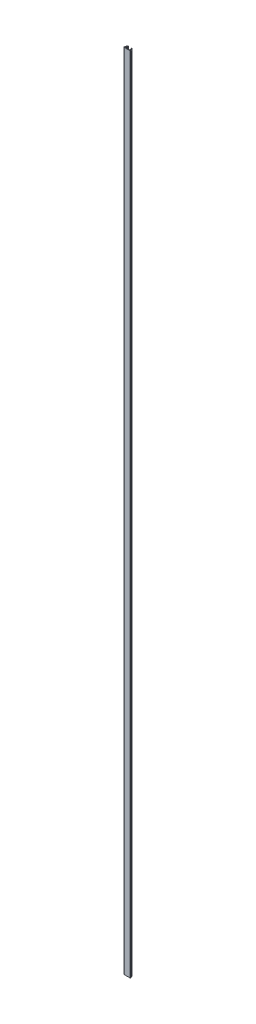
ISO-10303-21;
HEADER;
FILE_DESCRIPTION(('STEP AP214'),'2;1');
FILE_NAME('part.step','',(''),(''),'','','');
FILE_SCHEMA(('AUTOMOTIVE_DESIGN { 1 0 10303 214 1 1 1 1 }'));
ENDSEC;
DATA;
#1=APPLICATION_CONTEXT('core data for automotive mechanical design processes');
#2=APPLICATION_PROTOCOL_DEFINITION('international standard','automotive_design',2000,#1);
#3=PRODUCT_CONTEXT('',#1,'mechanical');
#4=PRODUCT('Part','Part','',(#3));
#5=PRODUCT_RELATED_PRODUCT_CATEGORY('part','',(#4));
#6=PRODUCT_DEFINITION_FORMATION('','',#4);
#7=PRODUCT_DEFINITION_CONTEXT('part definition',#1,'design');
#8=PRODUCT_DEFINITION('design','',#6,#7);
#9=PRODUCT_DEFINITION_SHAPE('','',#8);
#10=(LENGTH_UNIT() NAMED_UNIT(*) SI_UNIT(.MILLI.,.METRE.));
#11=(NAMED_UNIT(*) PLANE_ANGLE_UNIT() SI_UNIT($,.RADIAN.));
#12=(NAMED_UNIT(*) SI_UNIT($,.STERADIAN.) SOLID_ANGLE_UNIT());
#13=UNCERTAINTY_MEASURE_WITH_UNIT(LENGTH_MEASURE(1.E-05),#10,'distance_accuracy_value','');
#14=(GEOMETRIC_REPRESENTATION_CONTEXT(3) GLOBAL_UNCERTAINTY_ASSIGNED_CONTEXT((#13)) GLOBAL_UNIT_ASSIGNED_CONTEXT((#10,
#11,#12)) REPRESENTATION_CONTEXT('',''));
#15=CARTESIAN_POINT('',(0.,0.,0.));
#16=DIRECTION('',(0.,0.,1.));
#17=DIRECTION('',(1.,0.,0.));
#18=AXIS2_PLACEMENT_3D('',#15,#16,#17);
#19=CARTESIAN_POINT('',(2.65573064766504,1180.,-3.30246448484874));
#20=DIRECTION('',(0.,-1.,0.));
#21=DIRECTION('',(0.,0.,-1.));
#22=AXIS2_PLACEMENT_3D('',#19,#20,#21);
#23=CYLINDRICAL_SURFACE('',#22,0.40000394012978);
#24=CARTESIAN_POINT('',(2.65573064766504,1180.,-3.30246448484874));
#25=DIRECTION('',(0.,-1.,0.));
#26=DIRECTION('',(0.,0.,-1.));
#27=AXIS2_PLACEMENT_3D('',#24,#25,#26);
#28=CIRCLE('',#27,0.40000394012978);
#29=CARTESIAN_POINT('',(2.40672362175113,1180.,-2.98941711917829));
#30=VERTEX_POINT('',#29);
#31=CARTESIAN_POINT('',(2.90473880006085,1180.,-3.61551095447925));
#32=VERTEX_POINT('',#31);
#33=EDGE_CURVE('E227',#30,#32,#28,.T.);
#34=ORIENTED_EDGE('',*,*,#33,.T.);
#35=DIRECTION('',(0.,1.,0.));
#36=VECTOR('',#35,1.);
#37=CARTESIAN_POINT('',(2.90473725827043,1180.,-3.61551218088588));
#38=LINE('',#37,#36);
#39=CARTESIAN_POINT('',(2.90473880006185,0.,-3.61551095448257));
#40=VERTEX_POINT('',#39);
#41=EDGE_CURVE('E229',#40,#32,#38,.T.);
#42=ORIENTED_EDGE('',*,*,#41,.F.);
#43=CARTESIAN_POINT('',(2.65573064766504,0.,-3.30246448485286));
#44=DIRECTION('',(0.,-1.,0.));
#45=DIRECTION('',(0.,0.,-1.));
#46=AXIS2_PLACEMENT_3D('',#43,#44,#45);
#47=CIRCLE('',#46,0.40000394012978);
#48=CARTESIAN_POINT('',(2.40672362175213,0.,-2.98941711918161));
#49=VERTEX_POINT('',#48);
#50=EDGE_CURVE('E20',#40,#49,#47,.F.);
#51=ORIENTED_EDGE('',*,*,#50,.T.);
#52=DIRECTION('',(0.,1.,0.));
#53=VECTOR('',#52,1.);
#54=CARTESIAN_POINT('',(2.40672207996582,1180.,-2.989418345547));
#55=LINE('',#54,#53);
#56=EDGE_CURVE('E251',#30,#49,#55,.F.);
#57=ORIENTED_EDGE('',*,*,#56,.F.);
#58=EDGE_LOOP('',(#34,#42,#51,#57));
#59=FACE_BOUND('',#58,.T.);
#60=ADVANCED_FACE('F17',(#59),#23,.T.);
#61=CARTESIAN_POINT('',(-2.65573064766504,1180.,-3.30246448484874));
#62=DIRECTION('',(0.,-1.,0.));
#63=DIRECTION('',(0.,0.,-1.));
#64=AXIS2_PLACEMENT_3D('',#61,#62,#63);
#65=CYLINDRICAL_SURFACE('',#64,0.400003940129779);
#66=CARTESIAN_POINT('',(-2.65573064766504,0.,-3.30246448485286));
#67=DIRECTION('',(0.,-1.,0.));
#68=DIRECTION('',(0.,0.,-1.));
#69=AXIS2_PLACEMENT_3D('',#66,#67,#68);
#70=CIRCLE('',#69,0.400003940129779);
#71=CARTESIAN_POINT('',(-2.40672362175112,0.,-2.9894171191824));
#72=VERTEX_POINT('',#71);
#73=CARTESIAN_POINT('',(-2.90473880006286,0.,-3.61551095448178));
#74=VERTEX_POINT('',#73);
#75=EDGE_CURVE('E238',#72,#74,#70,.F.);
#76=ORIENTED_EDGE('',*,*,#75,.T.);
#77=DIRECTION('',(0.,1.,0.));
#78=VECTOR('',#77,1.);
#79=CARTESIAN_POINT('',(-2.90473725827245,1180.,-3.61551218088429));
#80=LINE('',#79,#78);
#81=CARTESIAN_POINT('',(-2.90473880006186,1180.,-3.61551095447846));
#82=VERTEX_POINT('',#81);
#83=EDGE_CURVE('E246',#82,#74,#80,.F.);
#84=ORIENTED_EDGE('',*,*,#83,.F.);
#85=CARTESIAN_POINT('',(-2.65573064766504,1180.,-3.30246448484874));
#86=DIRECTION('',(0.,-1.,0.));
#87=DIRECTION('',(0.,0.,-1.));
#88=AXIS2_PLACEMENT_3D('',#85,#86,#87);
#89=CIRCLE('',#88,0.400003940129779);
#90=CARTESIAN_POINT('',(-2.40672362175012,1180.,-2.98941711917908));
#91=VERTEX_POINT('',#90);
#92=EDGE_CURVE('E241',#82,#91,#89,.T.);
#93=ORIENTED_EDGE('',*,*,#92,.T.);
#94=DIRECTION('',(0.,1.,0.));
#95=VECTOR('',#94,1.);
#96=CARTESIAN_POINT('',(-2.4067220799638,1180.,-2.98941834554859));
#97=LINE('',#96,#95);
#98=EDGE_CURVE('E255',#72,#91,#97,.T.);
#99=ORIENTED_EDGE('',*,*,#98,.F.);
#100=EDGE_LOOP('',(#76,#84,#93,#99));
#101=FACE_BOUND('',#100,.T.);
#102=ADVANCED_FACE('F350',(#101),#65,.T.);
#103=CARTESIAN_POINT('',(2.90473725827244,1180.,-3.61551218088428));
#104=DIRECTION('',(0.622518103490472,0.,-0.7826053991806));
#105=DIRECTION('',(-0.7826053991806,0.,-0.622518103490472));
#106=AXIS2_PLACEMENT_3D('',#103,#104,#105);
#107=PLANE('',#106);
#108=DIRECTION('',(-0.7826053991806,0.,-0.622518103490472));
#109=VECTOR('',#108,1.);
#110=CARTESIAN_POINT('',(2.90473725827244,1180.,-3.61551218088428));
#111=LINE('',#110,#109);
#112=CARTESIAN_POINT('',(3.7224190253596,1180.,-2.96509282083541));
#113=VERTEX_POINT('',#112);
#114=EDGE_CURVE('E232',#32,#113,#111,.F.);
#115=ORIENTED_EDGE('',*,*,#114,.T.);
#116=DIRECTION('',(0.,-1.,0.));
#117=VECTOR('',#116,1.);
#118=CARTESIAN_POINT('',(3.72241720460955,1180.,-2.96509426913857));
#119=LINE('',#118,#117);
#120=CARTESIAN_POINT('',(3.7224190253596,0.,-2.96509282083953));
#121=VERTEX_POINT('',#120);
#122=EDGE_CURVE('E236',#121,#113,#119,.F.);
#123=ORIENTED_EDGE('',*,*,#122,.F.);
#124=DIRECTION('',(-0.7826053991806,0.,-0.622518103490472));
#125=VECTOR('',#124,1.);
#126=CARTESIAN_POINT('',(2.90473725827445,0.,-3.6155121808868));
#127=LINE('',#126,#125);
#128=EDGE_CURVE('E220',#121,#40,#127,.T.);
#129=ORIENTED_EDGE('',*,*,#128,.T.);
#130=ORIENTED_EDGE('',*,*,#41,.T.);
#131=EDGE_LOOP('',(#115,#123,#129,#130));
#132=FACE_BOUND('',#131,.T.);
#133=ADVANCED_FACE('F234',(#132),#107,.T.);
#134=CARTESIAN_POINT('',(-2.40672207996581,1180.,-2.98941834554699));
#135=DIRECTION('',(0.622507578450082,0.,0.782613771136322));
#136=DIRECTION('',(0.782613771136322,0.,-0.622507578450082));
#137=AXIS2_PLACEMENT_3D('',#134,#135,#136);
#138=PLANE('',#137);
#139=DIRECTION('',(0.782613771136322,0.,-0.622507578450082));
#140=VECTOR('',#139,1.);
#141=CARTESIAN_POINT('',(-2.40672207996581,1180.,-2.98941834554699));
#142=LINE('',#141,#140);
#143=CARTESIAN_POINT('',(-3.22440293600794,1180.,-2.33901766463294));
#144=VERTEX_POINT('',#143);
#145=EDGE_CURVE('E257',#91,#144,#142,.F.);
#146=ORIENTED_EDGE('',*,*,#145,.T.);
#147=DIRECTION('',(0.,-1.,0.));
#148=VECTOR('',#147,1.);
#149=CARTESIAN_POINT('',(-3.22440445835369,1180.,-2.33901645372688));
#150=LINE('',#149,#148);
#151=CARTESIAN_POINT('',(-3.22440293600794,0.,-2.33901766463706));
#152=VERTEX_POINT('',#151);
#153=EDGE_CURVE('E340',#144,#152,#150,.T.);
#154=ORIENTED_EDGE('',*,*,#153,.T.);
#155=DIRECTION('',(0.782613771136322,0.,-0.622507578450082));
#156=VECTOR('',#155,1.);
#157=CARTESIAN_POINT('',(-2.40672207996782,0.,-2.98941834554951));
#158=LINE('',#157,#156);
#159=EDGE_CURVE('E258',#152,#72,#158,.T.);
#160=ORIENTED_EDGE('',*,*,#159,.T.);
#161=ORIENTED_EDGE('',*,*,#98,.T.);
#162=EDGE_LOOP('',(#146,#154,#160,#161));
#163=FACE_BOUND('',#162,.T.);
#164=ADVANCED_FACE('F360',(#163),#138,.T.);
#165=CARTESIAN_POINT('',(3.22440445835369,1180.,-2.33901645372688));
#166=DIRECTION('',(-0.622507578450082,0.,0.782613771136322));
#167=DIRECTION('',(0.782613771136322,0.,0.622507578450082));
#168=AXIS2_PLACEMENT_3D('',#165,#166,#167);
#169=PLANE('',#168);
#170=DIRECTION('',(0.782613771136322,0.,0.622507578450082));
#171=VECTOR('',#170,1.);
#172=CARTESIAN_POINT('',(3.22440445835369,1180.,-2.33901645372688));
#173=LINE('',#172,#171);
#174=CARTESIAN_POINT('',(3.22440293600795,1180.,-2.33901766463294));
#175=VERTEX_POINT('',#174);
#176=EDGE_CURVE('E254',#175,#30,#173,.F.);
#177=ORIENTED_EDGE('',*,*,#176,.T.);
#178=ORIENTED_EDGE('',*,*,#56,.T.);
#179=DIRECTION('',(0.782613771136322,0.,0.622507578450082));
#180=VECTOR('',#179,1.);
#181=CARTESIAN_POINT('',(3.2244044583557,0.,-2.3390164537294));
#182=LINE('',#181,#180);
#183=CARTESIAN_POINT('',(3.22440293600795,0.,-2.33901766463706));
#184=VERTEX_POINT('',#183);
#185=EDGE_CURVE('E223',#49,#184,#182,.T.);
#186=ORIENTED_EDGE('',*,*,#185,.T.);
#187=DIRECTION('',(0.,-1.,0.));
#188=VECTOR('',#187,1.);
#189=CARTESIAN_POINT('',(3.22440445835369,1180.,-2.33901645372688));
#190=LINE('',#189,#188);
#191=EDGE_CURVE('E335',#184,#175,#190,.F.);
#192=ORIENTED_EDGE('',*,*,#191,.T.);
#193=EDGE_LOOP('',(#177,#178,#186,#192));
#194=FACE_BOUND('',#193,.T.);
#195=ADVANCED_FACE('F459',(#194),#169,.T.);
#196=CARTESIAN_POINT('',(-3.72241720460956,1180.,-2.96509426913857));
#197=DIRECTION('',(-0.622518103490471,0.,-0.7826053991806));
#198=DIRECTION('',(-0.7826053991806,0.,0.622518103490471));
#199=AXIS2_PLACEMENT_3D('',#196,#197,#198);
#200=PLANE('',#199);
#201=DIRECTION('',(-0.7826053991806,0.,0.622518103490471));
#202=VECTOR('',#201,1.);
#203=CARTESIAN_POINT('',(-3.72241720460956,1180.,-2.96509426913857));
#204=LINE('',#203,#202);
#205=CARTESIAN_POINT('',(-3.7224190253596,1180.,-2.96509282083542));
#206=VERTEX_POINT('',#205);
#207=EDGE_CURVE('E250',#206,#82,#204,.F.);
#208=ORIENTED_EDGE('',*,*,#207,.T.);
#209=ORIENTED_EDGE('',*,*,#83,.T.);
#210=DIRECTION('',(-0.7826053991806,0.,0.622518103490471));
#211=VECTOR('',#210,1.);
#212=CARTESIAN_POINT('',(-3.72241720461157,-4.44089209850063E-13,-2.96509426914109));
#213=LINE('',#212,#211);
#214=CARTESIAN_POINT('',(-3.7224190253596,0.,-2.96509282083954));
#215=VERTEX_POINT('',#214);
#216=EDGE_CURVE('E253',#74,#215,#213,.T.);
#217=ORIENTED_EDGE('',*,*,#216,.T.);
#218=DIRECTION('',(0.,-1.,0.));
#219=VECTOR('',#218,1.);
#220=CARTESIAN_POINT('',(-3.72241720460956,1180.,-2.96509426913856));
#221=LINE('',#220,#219);
#222=EDGE_CURVE('E329',#206,#215,#221,.T.);
#223=ORIENTED_EDGE('',*,*,#222,.F.);
#224=EDGE_LOOP('',(#208,#209,#217,#223));
#225=FACE_BOUND('',#224,.T.);
#226=ADVANCED_FACE('F586',(#225),#200,.T.);
#227=CARTESIAN_POINT('',(3.09990726176315,1180.,-2.18249165464262));
#228=DIRECTION('',(0.,-1.,0.));
#229=DIRECTION('',(0.,0.,-1.));
#230=AXIS2_PLACEMENT_3D('',#227,#228,#229);
#231=CYLINDRICAL_SURFACE('',#230,0.999992740552911);
#232=CARTESIAN_POINT('',(3.09990726176315,1180.,-2.18249165464262));
#233=DIRECTION('',(0.,-1.,0.));
#234=DIRECTION('',(0.,0.,-1.));
#235=AXIS2_PLACEMENT_3D('',#232,#233,#234);
#236=CIRCLE('',#235,0.999992740552911);
#237=CARTESIAN_POINT('',(4.099900000451,1180.,-2.18255271238236));
#238=VERTEX_POINT('',#237);
#239=EDGE_CURVE('E343',#113,#238,#236,.T.);
#240=ORIENTED_EDGE('',*,*,#239,.T.);
#241=DIRECTION('',(0.,1.,0.));
#242=VECTOR('',#241,1.);
#243=CARTESIAN_POINT('',(4.09990000050218,1180.,-2.18255188528575));
#244=LINE('',#243,#242);
#245=CARTESIAN_POINT('',(4.099900000451,0.,-2.18255271238442));
#246=VERTEX_POINT('',#245);
#247=EDGE_CURVE('E371',#246,#238,#244,.T.);
#248=ORIENTED_EDGE('',*,*,#247,.F.);
#249=CARTESIAN_POINT('',(3.09990726176315,0.,-2.18249165464674));
#250=DIRECTION('',(0.,-1.,0.));
#251=DIRECTION('',(0.,0.,-1.));
#252=AXIS2_PLACEMENT_3D('',#249,#250,#251);
#253=CIRCLE('',#252,0.999992740552911);
#254=EDGE_CURVE('E249',#246,#121,#253,.F.);
#255=ORIENTED_EDGE('',*,*,#254,.T.);
#256=ORIENTED_EDGE('',*,*,#122,.T.);
#257=EDGE_LOOP('',(#240,#248,#255,#256));
#258=FACE_BOUND('',#257,.T.);
#259=ADVANCED_FACE('F366',(#258),#231,.T.);
#260=CARTESIAN_POINT('',(-3.09991592727241,1180.,-2.182516273277));
#261=DIRECTION('',(0.,-1.,0.));
#262=DIRECTION('',(0.,0.,-1.));
#263=AXIS2_PLACEMENT_3D('',#260,#261,#262);
#264=CYLINDRICAL_SURFACE('',#263,0.199974250471449);
#265=ORIENTED_EDGE('',*,*,#153,.F.);
#266=CARTESIAN_POINT('',(-3.09991592727241,1180.,-2.182516273277));
#267=DIRECTION('',(0.,-1.,0.));
#268=DIRECTION('',(0.,0.,-1.));
#269=AXIS2_PLACEMENT_3D('',#266,#267,#268);
#270=CIRCLE('',#269,0.199974250471449);
#271=CARTESIAN_POINT('',(-3.29988999532591,1180.,-2.18224616634789));
#272=VERTEX_POINT('',#271);
#273=EDGE_CURVE('E341',#272,#144,#270,.T.);
#274=ORIENTED_EDGE('',*,*,#273,.F.);
#275=DIRECTION('',(0.,1.,0.));
#276=VECTOR('',#275,1.);
#277=CARTESIAN_POINT('',(-3.29988999532591,1180.,-2.18224616634995));
#278=LINE('',#277,#276);
#279=CARTESIAN_POINT('',(-3.2998899953259,0.,-2.18224616634995));
#280=VERTEX_POINT('',#279);
#281=EDGE_CURVE('E434',#280,#272,#278,.T.);
#282=ORIENTED_EDGE('',*,*,#281,.F.);
#283=CARTESIAN_POINT('',(-3.09991592727241,0.,-2.18251627328112));
#284=DIRECTION('',(0.,-1.,0.));
#285=DIRECTION('',(0.,0.,-1.));
#286=AXIS2_PLACEMENT_3D('',#283,#284,#285);
#287=CIRCLE('',#286,0.199974250471449);
#288=EDGE_CURVE('E338',#152,#280,#287,.F.);
#289=ORIENTED_EDGE('',*,*,#288,.F.);
#290=EDGE_LOOP('',(#265,#274,#282,#289));
#291=FACE_BOUND('',#290,.T.);
#292=ADVANCED_FACE('F576',(#291),#264,.F.);
#293=CARTESIAN_POINT('',(3.09991592727241,1180.,-2.182516273277));
#294=DIRECTION('',(0.,-1.,0.));
#295=DIRECTION('',(0.,0.,-1.));
#296=AXIS2_PLACEMENT_3D('',#293,#294,#295);
#297=CYLINDRICAL_SURFACE('',#296,0.199974250471451);
#298=ORIENTED_EDGE('',*,*,#191,.F.);
#299=CARTESIAN_POINT('',(3.09991592727241,0.,-2.18251627328112));
#300=DIRECTION('',(0.,-1.,0.));
#301=DIRECTION('',(0.,0.,-1.));
#302=AXIS2_PLACEMENT_3D('',#299,#300,#301);
#303=CIRCLE('',#302,0.199974250471451);
#304=CARTESIAN_POINT('',(3.29988999532589,0.,-2.18224616634583));
#305=VERTEX_POINT('',#304);
#306=EDGE_CURVE('E336',#305,#184,#303,.F.);
#307=ORIENTED_EDGE('',*,*,#306,.F.);
#308=DIRECTION('',(0.,1.,0.));
#309=VECTOR('',#308,1.);
#310=CARTESIAN_POINT('',(3.2998899953259,1180.,-2.18224616634583));
#311=LINE('',#310,#309);
#312=CARTESIAN_POINT('',(3.2998899953259,1180.,-2.18224616634583));
#313=VERTEX_POINT('',#312);
#314=EDGE_CURVE('E418',#313,#305,#311,.F.);
#315=ORIENTED_EDGE('',*,*,#314,.F.);
#316=CARTESIAN_POINT('',(3.09991592727241,1180.,-2.182516273277));
#317=DIRECTION('',(0.,-1.,0.));
#318=DIRECTION('',(0.,0.,-1.));
#319=AXIS2_PLACEMENT_3D('',#316,#317,#318);
#320=CIRCLE('',#319,0.199974250471451);
#321=EDGE_CURVE('E333',#175,#313,#320,.T.);
#322=ORIENTED_EDGE('',*,*,#321,.F.);
#323=EDGE_LOOP('',(#298,#307,#315,#322));
#324=FACE_BOUND('',#323,.T.);
#325=ADVANCED_FACE('F463',(#324),#297,.F.);
#326=CARTESIAN_POINT('',(-3.09990726176314,1180.,-2.18249165464262));
#327=DIRECTION('',(0.,-1.,0.));
#328=DIRECTION('',(0.,0.,-1.));
#329=AXIS2_PLACEMENT_3D('',#326,#327,#328);
#330=CYLINDRICAL_SURFACE('',#329,0.999992740552918);
#331=CARTESIAN_POINT('',(-3.09990726176314,1180.,-2.18249165464262));
#332=DIRECTION('',(0.,-1.,0.));
#333=DIRECTION('',(0.,0.,-1.));
#334=AXIS2_PLACEMENT_3D('',#331,#332,#333);
#335=CIRCLE('',#334,0.999992740552918);
#336=CARTESIAN_POINT('',(-4.099900000451,1180.,-2.1825527123803));
#337=VERTEX_POINT('',#336);
#338=EDGE_CURVE('E326',#337,#206,#335,.T.);
#339=ORIENTED_EDGE('',*,*,#338,.T.);
#340=ORIENTED_EDGE('',*,*,#222,.T.);
#341=CARTESIAN_POINT('',(-3.09990726176314,0.,-2.18249165464674));
#342=DIRECTION('',(0.,-1.,0.));
#343=DIRECTION('',(0.,0.,-1.));
#344=AXIS2_PLACEMENT_3D('',#341,#342,#343);
#345=CIRCLE('',#344,0.999992740552918);
#346=CARTESIAN_POINT('',(-4.099900000451,0.,-2.18255271238236));
#347=VERTEX_POINT('',#346);
#348=EDGE_CURVE('E330',#215,#347,#345,.F.);
#349=ORIENTED_EDGE('',*,*,#348,.T.);
#350=DIRECTION('',(0.,1.,0.));
#351=VECTOR('',#350,1.);
#352=CARTESIAN_POINT('',(-4.09990000050218,1180.,-2.18255188528163));
#353=LINE('',#352,#351);
#354=EDGE_CURVE('E393',#337,#347,#353,.F.);
#355=ORIENTED_EDGE('',*,*,#354,.F.);
#356=EDGE_LOOP('',(#339,#340,#349,#355));
#357=FACE_BOUND('',#356,.T.);
#358=ADVANCED_FACE('F584',(#357),#330,.T.);
#359=CARTESIAN_POINT('',(4.09990000050218,1180.,-2.18255188528163));
#360=DIRECTION('',(0.999999998085106,0.,-6.18852856022626E-05));
#361=DIRECTION('',(-6.18852856022626E-05,0.,-0.999999998085106));
#362=AXIS2_PLACEMENT_3D('',#359,#360,#361);
#363=PLANE('',#362);
#364=DIRECTION('',(-6.18852856022626E-05,0.,-0.999999998085106));
#365=VECTOR('',#364,1.);
#366=CARTESIAN_POINT('',(4.09990000050218,1180.,-2.18255188528163));
#367=LINE('',#366,#365);
#368=CARTESIAN_POINT('',(4.10000000000075,1180.,-0.566666999998405));
#369=VERTEX_POINT('',#368);
#370=EDGE_CURVE('E385',#238,#369,#367,.F.);
#371=ORIENTED_EDGE('',*,*,#370,.T.);
#372=DIRECTION('',(0.,1.,0.));
#373=VECTOR('',#372,1.);
#374=CARTESIAN_POINT('',(4.10000000000112,1180.,-0.566666999999668));
#375=LINE('',#374,#373);
#376=CARTESIAN_POINT('',(4.1,-5.18104078158406E-13,-0.566667));
#377=VERTEX_POINT('',#376);
#378=EDGE_CURVE('E383',#377,#369,#375,.T.);
#379=ORIENTED_EDGE('',*,*,#378,.F.);
#380=DIRECTION('',(-6.18852856022626E-05,0.,-0.999999998085106));
#381=VECTOR('',#380,1.);
#382=CARTESIAN_POINT('',(4.09990000050218,0.,-2.18255188528163));
#383=LINE('',#382,#381);
#384=EDGE_CURVE('E374',#377,#246,#383,.T.);
#385=ORIENTED_EDGE('',*,*,#384,.T.);
#386=ORIENTED_EDGE('',*,*,#247,.T.);
#387=EDGE_LOOP('',(#371,#379,#385,#386));
#388=FACE_BOUND('',#387,.T.);
#389=ADVANCED_FACE('F384',(#388),#363,.T.);
#390=CARTESIAN_POINT('',(-3.2998899953259,1180.,-2.18224616634583));
#391=DIRECTION('',(0.999999256740859,0.,-0.00121922833401724));
#392=DIRECTION('',(-0.00121922833401724,0.,-0.999999256740859));
#393=AXIS2_PLACEMENT_3D('',#390,#391,#392);
#394=PLANE('',#393);
#395=DIRECTION('',(-0.00121922833401724,0.,-0.999999256740859));
#396=VECTOR('',#395,1.);
#397=CARTESIAN_POINT('',(-3.2998899953259,1180.,-2.18224616634583));
#398=LINE('',#397,#396);
#399=CARTESIAN_POINT('',(-3.29824000607564,1180.,-0.828940983180645));
#400=VERTEX_POINT('',#399);
#401=EDGE_CURVE('E426',#272,#400,#398,.F.);
#402=ORIENTED_EDGE('',*,*,#401,.T.);
#403=DIRECTION('',(0.,-1.,0.));
#404=VECTOR('',#403,1.);
#405=CARTESIAN_POINT('',(-3.29824000459741,1180.,-0.828939770750054));
#406=LINE('',#405,#404);
#407=CARTESIAN_POINT('',(-3.29824000607564,0.,-0.828940983184765));
#408=VERTEX_POINT('',#407);
#409=EDGE_CURVE('E322',#400,#408,#406,.T.);
#410=ORIENTED_EDGE('',*,*,#409,.T.);
#411=DIRECTION('',(-0.00121922833401724,0.,-0.999999256740859));
#412=VECTOR('',#411,1.);
#413=CARTESIAN_POINT('',(-3.29988999532589,0.,-2.18224616634583));
#414=LINE('',#413,#412);
#415=EDGE_CURVE('E431',#408,#280,#414,.T.);
#416=ORIENTED_EDGE('',*,*,#415,.T.);
#417=ORIENTED_EDGE('',*,*,#281,.T.);
#418=EDGE_LOOP('',(#402,#410,#416,#417));
#419=FACE_BOUND('',#418,.T.);
#420=ADVANCED_FACE('F574',(#419),#394,.T.);
#421=CARTESIAN_POINT('',(3.29824000459741,1180.,-0.828939770750054));
#422=DIRECTION('',(-0.999999256740859,0.,-0.00121922833401724));
#423=DIRECTION('',(-0.00121922833401724,0.,0.999999256740859));
#424=AXIS2_PLACEMENT_3D('',#421,#422,#423);
#425=PLANE('',#424);
#426=DIRECTION('',(-0.00121922833401724,0.,0.999999256740859));
#427=VECTOR('',#426,1.);
#428=CARTESIAN_POINT('',(3.29824000459741,1180.,-0.828939770750054));
#429=LINE('',#428,#427);
#430=CARTESIAN_POINT('',(3.29824000607564,1180.,-0.828940983180645));
#431=VERTEX_POINT('',#430);
#432=EDGE_CURVE('E425',#431,#313,#429,.F.);
#433=ORIENTED_EDGE('',*,*,#432,.T.);
#434=ORIENTED_EDGE('',*,*,#314,.T.);
#435=DIRECTION('',(-0.00121922833401724,0.,0.999999256740859));
#436=VECTOR('',#435,1.);
#437=CARTESIAN_POINT('',(3.2982400045974,0.,-0.828939770750054));
#438=LINE('',#437,#436);
#439=CARTESIAN_POINT('',(3.29824000607564,0.,-0.828940983184765));
#440=VERTEX_POINT('',#439);
#441=EDGE_CURVE('E423',#305,#440,#438,.T.);
#442=ORIENTED_EDGE('',*,*,#441,.T.);
#443=DIRECTION('',(0.,-1.,0.));
#444=VECTOR('',#443,1.);
#445=CARTESIAN_POINT('',(3.29824000459742,1180.,-0.828939770750054));
#446=LINE('',#445,#444);
#447=EDGE_CURVE('E319',#440,#431,#446,.F.);
#448=ORIENTED_EDGE('',*,*,#447,.T.);
#449=EDGE_LOOP('',(#433,#434,#442,#448));
#450=FACE_BOUND('',#449,.T.);
#451=ADVANCED_FACE('F648',(#450),#425,.T.);
#452=CARTESIAN_POINT('',(-4.1,1180.,-0.56666699999588));
#453=DIRECTION('',(-0.999999998085106,0.,-6.18852856022626E-05));
#454=DIRECTION('',(-6.18852856022626E-05,0.,0.999999998085106));
#455=AXIS2_PLACEMENT_3D('',#452,#453,#454);
#456=PLANE('',#455);
#457=DIRECTION('',(-6.18852856022626E-05,0.,0.999999998085106));
#458=VECTOR('',#457,1.);
#459=CARTESIAN_POINT('',(-4.1,1180.,-0.56666699999588));
#460=LINE('',#459,#458);
#461=CARTESIAN_POINT('',(-4.1,1180.,-0.566666999995879));
#462=VERTEX_POINT('',#461);
#463=EDGE_CURVE('E396',#462,#337,#460,.F.);
#464=ORIENTED_EDGE('',*,*,#463,.T.);
#465=ORIENTED_EDGE('',*,*,#354,.T.);
#466=DIRECTION('',(-6.18852856022626E-05,0.,0.999999998085106));
#467=VECTOR('',#466,1.);
#468=CARTESIAN_POINT('',(-4.1,0.,-0.56666699999588));
#469=LINE('',#468,#467);
#470=CARTESIAN_POINT('',(-4.09999999999925,-3.70074341541719E-13,-0.566666999996632));
#471=VERTEX_POINT('',#470);
#472=EDGE_CURVE('E413',#347,#471,#469,.T.);
#473=ORIENTED_EDGE('',*,*,#472,.T.);
#474=DIRECTION('',(0.,1.,0.));
#475=VECTOR('',#474,1.);
#476=CARTESIAN_POINT('',(-4.1,1180.,-0.566666999995879));
#477=LINE('',#476,#475);
#478=EDGE_CURVE('E312',#462,#471,#477,.F.);
#479=ORIENTED_EDGE('',*,*,#478,.F.);
#480=EDGE_LOOP('',(#464,#465,#473,#479));
#481=FACE_BOUND('',#480,.T.);
#482=ADVANCED_FACE('F645',(#481),#456,.T.);
#483=CARTESIAN_POINT('',(4.1,1180.,-0.56666699999588));
#484=DIRECTION('',(0.958836124858907,0.,0.283960007158674));
#485=DIRECTION('',(0.283960007158674,0.,-0.958836124858907));
#486=AXIS2_PLACEMENT_3D('',#483,#484,#485);
#487=PLANE('',#486);
#488=DIRECTION('',(0.283960007158674,0.,-0.958836124858907));
#489=VECTOR('',#488,1.);
#490=CARTESIAN_POINT('',(4.1,1180.,-0.56666699999588));
#491=LINE('',#490,#489);
#492=CARTESIAN_POINT('',(4.00823095894383,1180.,-0.256794238022215));
#493=VERTEX_POINT('',#492);
#494=EDGE_CURVE('E325',#369,#493,#491,.F.);
#495=ORIENTED_EDGE('',*,*,#494,.T.);
#496=DIRECTION('',(0.,-1.,0.));
#497=VECTOR('',#496,1.);
#498=CARTESIAN_POINT('',(4.00823049642058,1180.,-0.256792676238905));
#499=LINE('',#498,#497);
#500=CARTESIAN_POINT('',(4.00823095894383,-2.21945459351937E-13,-0.256794238026335));
#501=VERTEX_POINT('',#500);
#502=EDGE_CURVE('E309',#493,#501,#499,.T.);
#503=ORIENTED_EDGE('',*,*,#502,.T.);
#504=DIRECTION('',(0.283960007158674,0.,-0.958836124858907));
#505=VECTOR('',#504,1.);
#506=CARTESIAN_POINT('',(4.09999999999888,-4.44089209850063E-13,-0.566666999996212));
#507=LINE('',#506,#505);
#508=EDGE_CURVE('E377',#501,#377,#507,.T.);
#509=ORIENTED_EDGE('',*,*,#508,.T.);
#510=ORIENTED_EDGE('',*,*,#378,.T.);
#511=EDGE_LOOP('',(#495,#503,#509,#510));
#512=FACE_BOUND('',#511,.T.);
#513=ADVANCED_FACE('F390',(#512),#487,.T.);
#514=CARTESIAN_POINT('',(-2.29827864130302,1180.,-0.830161377748061));
#515=DIRECTION('',(0.,-1.,0.));
#516=DIRECTION('',(0.,0.,-1.));
#517=AXIS2_PLACEMENT_3D('',#514,#515,#516);
#518=CYLINDRICAL_SURFACE('',#517,0.999962109484775);
#519=ORIENTED_EDGE('',*,*,#409,.F.);
#520=CARTESIAN_POINT('',(-2.29827864130302,1180.,-0.830161377748061));
#521=DIRECTION('',(0.,-1.,0.));
#522=DIRECTION('',(0.,0.,-1.));
#523=AXIS2_PLACEMENT_3D('',#520,#521,#522);
#524=CIRCLE('',#523,0.999962109484775);
#525=CARTESIAN_POINT('',(-3.25671357694209,1180.,-0.54498302206207));
#526=VERTEX_POINT('',#525);
#527=EDGE_CURVE('E323',#526,#400,#524,.T.);
#528=ORIENTED_EDGE('',*,*,#527,.F.);
#529=DIRECTION('',(0.,1.,0.));
#530=VECTOR('',#529,1.);
#531=CARTESIAN_POINT('',(-3.25671357694266,1180.,-0.544983022063962));
#532=LINE('',#531,#530);
#533=CARTESIAN_POINT('',(-3.25671357694153,0.,-0.544983022064297));
#534=VERTEX_POINT('',#533);
#535=EDGE_CURVE('E536',#534,#526,#532,.T.);
#536=ORIENTED_EDGE('',*,*,#535,.F.);
#537=CARTESIAN_POINT('',(-2.29827864130302,0.,-0.830161377752181));
#538=DIRECTION('',(0.,-1.,0.));
#539=DIRECTION('',(0.,0.,-1.));
#540=AXIS2_PLACEMENT_3D('',#537,#538,#539);
#541=CIRCLE('',#540,0.999962109484775);
#542=EDGE_CURVE('E320',#408,#534,#541,.F.);
#543=ORIENTED_EDGE('',*,*,#542,.F.);
#544=EDGE_LOOP('',(#519,#528,#536,#543));
#545=FACE_BOUND('',#544,.T.);
#546=ADVANCED_FACE('F560',(#545),#518,.F.);
#547=CARTESIAN_POINT('',(2.29827864130302,1180.,-0.83016137774806));
#548=DIRECTION('',(0.,-1.,0.));
#549=DIRECTION('',(0.,0.,-1.));
#550=AXIS2_PLACEMENT_3D('',#547,#548,#549);
#551=CYLINDRICAL_SURFACE('',#550,0.999962109484778);
#552=DIRECTION('',(0.,1.,0.));
#553=VECTOR('',#552,1.);
#554=CARTESIAN_POINT('',(3.25671357694153,1180.,-0.544983022060175));
#555=LINE('',#554,#553);
#556=CARTESIAN_POINT('',(3.25671357694153,1180.,-0.544983022060176));
#557=VERTEX_POINT('',#556);
#558=CARTESIAN_POINT('',(3.25671357694041,0.,-0.544983022060511));
#559=VERTEX_POINT('',#558);
#560=EDGE_CURVE('E305',#557,#559,#555,.F.);
#561=ORIENTED_EDGE('',*,*,#560,.F.);
#562=CARTESIAN_POINT('',(2.29827864130302,1180.,-0.83016137774806));
#563=DIRECTION('',(0.,-1.,0.));
#564=DIRECTION('',(0.,0.,-1.));
#565=AXIS2_PLACEMENT_3D('',#562,#563,#564);
#566=CIRCLE('',#565,0.999962109484778);
#567=EDGE_CURVE('E317',#431,#557,#566,.T.);
#568=ORIENTED_EDGE('',*,*,#567,.F.);
#569=ORIENTED_EDGE('',*,*,#447,.F.);
#570=CARTESIAN_POINT('',(2.29827864130302,0.,-0.83016137775218));
#571=DIRECTION('',(0.,-1.,0.));
#572=DIRECTION('',(0.,0.,-1.));
#573=AXIS2_PLACEMENT_3D('',#570,#571,#572);
#574=CIRCLE('',#573,0.999962109484778);
#575=EDGE_CURVE('E313',#559,#440,#574,.F.);
#576=ORIENTED_EDGE('',*,*,#575,.F.);
#577=EDGE_LOOP('',(#561,#568,#569,#576));
#578=FACE_BOUND('',#577,.T.);
#579=ADVANCED_FACE('F636',(#578),#551,.F.);
#580=CARTESIAN_POINT('',(-4.00823049642058,1180.,-0.256792676238905));
#581=DIRECTION('',(-0.958836124858907,0.,0.283960007158674));
#582=DIRECTION('',(0.283960007158674,0.,0.958836124858907));
#583=AXIS2_PLACEMENT_3D('',#580,#581,#582);
#584=PLANE('',#583);
#585=DIRECTION('',(0.283960007158674,0.,0.958836124858907));
#586=VECTOR('',#585,1.);
#587=CARTESIAN_POINT('',(-4.00823049642058,1180.,-0.256792676238905));
#588=LINE('',#587,#586);
#589=CARTESIAN_POINT('',(-4.00823095894383,1180.,-0.256794238022214));
#590=VERTEX_POINT('',#589);
#591=EDGE_CURVE('E408',#590,#462,#588,.F.);
#592=ORIENTED_EDGE('',*,*,#591,.T.);
#593=ORIENTED_EDGE('',*,*,#478,.T.);
#594=DIRECTION('',(0.283960007158674,0.,0.958836124858907));
#595=VECTOR('',#594,1.);
#596=CARTESIAN_POINT('',(-4.00823049641946,-4.44089209850063E-13,-0.256792676239237));
#597=LINE('',#596,#595);
#598=CARTESIAN_POINT('',(-4.00823095894383,-2.21945459351937E-13,-0.256794238026334));
#599=VERTEX_POINT('',#598);
#600=EDGE_CURVE('E316',#471,#599,#597,.T.);
#601=ORIENTED_EDGE('',*,*,#600,.T.);
#602=DIRECTION('',(0.,-1.,0.));
#603=VECTOR('',#602,1.);
#604=CARTESIAN_POINT('',(-4.00823049642058,1180.,-0.256792676238905));
#605=LINE('',#604,#603);
#606=EDGE_CURVE('E302',#599,#590,#605,.F.);
#607=ORIENTED_EDGE('',*,*,#606,.T.);
#608=EDGE_LOOP('',(#592,#593,#601,#607));
#609=FACE_BOUND('',#608,.T.);
#610=ADVANCED_FACE('F633',(#609),#584,.T.);
#611=CARTESIAN_POINT('',(4.2000014829772,1180.,-0.200002958330922));
#612=DIRECTION('',(0.,-1.,0.));
#613=DIRECTION('',(0.,0.,-1.));
#614=AXIS2_PLACEMENT_3D('',#611,#612,#613);
#615=CYLINDRICAL_SURFACE('',#614,0.200002958340539);
#616=ORIENTED_EDGE('',*,*,#502,.F.);
#617=CARTESIAN_POINT('',(4.2000014829772,1180.,-0.200002958330922));
#618=DIRECTION('',(0.,-1.,0.));
#619=DIRECTION('',(0.,0.,-1.));
#620=AXIS2_PLACEMENT_3D('',#617,#618,#619);
#621=CIRCLE('',#620,0.200002958340539);
#622=CARTESIAN_POINT('',(4.2000007414886,1180.,4.1199411503906E-12));
#623=VERTEX_POINT('',#622);
#624=EDGE_CURVE('E310',#623,#493,#621,.T.);
#625=ORIENTED_EDGE('',*,*,#624,.F.);
#626=DIRECTION('',(0.,1.,0.));
#627=VECTOR('',#626,1.);
#628=CARTESIAN_POINT('',(4.2,1180.,4.1199479798349E-12));
#629=LINE('',#628,#627);
#630=CARTESIAN_POINT('',(4.2000007414886,0.,0.));
#631=VERTEX_POINT('',#630);
#632=EDGE_CURVE('E470',#631,#623,#629,.T.);
#633=ORIENTED_EDGE('',*,*,#632,.F.);
#634=CARTESIAN_POINT('',(4.2000014829772,0.,-0.200002958335042));
#635=DIRECTION('',(0.,-1.,0.));
#636=DIRECTION('',(0.,0.,-1.));
#637=AXIS2_PLACEMENT_3D('',#634,#635,#636);
#638=CIRCLE('',#637,0.200002958340539);
#639=EDGE_CURVE('E306',#501,#631,#638,.F.);
#640=ORIENTED_EDGE('',*,*,#639,.F.);
#641=EDGE_LOOP('',(#616,#625,#633,#640));
#642=FACE_BOUND('',#641,.T.);
#643=ADVANCED_FACE('F467',(#642),#615,.F.);
#644=CARTESIAN_POINT('',(-3.25671357694153,1180.,-0.544983022060177));
#645=DIRECTION('',(0.958475045284886,0.,-0.285176414813946));
#646=DIRECTION('',(-0.285176414813946,0.,-0.958475045284886));
#647=AXIS2_PLACEMENT_3D('',#644,#645,#646);
#648=PLANE('',#647);
#649=DIRECTION('',(-0.285176414813946,0.,-0.958475045284886));
#650=VECTOR('',#649,1.);
#651=CARTESIAN_POINT('',(-3.25671357694153,1180.,-0.544983022060177));
#652=LINE('',#651,#650);
#653=CARTESIAN_POINT('',(-3.13710006343409,1180.,-0.142963213197231));
#654=VERTEX_POINT('',#653);
#655=EDGE_CURVE('E529',#526,#654,#652,.F.);
#656=ORIENTED_EDGE('',*,*,#655,.T.);
#657=DIRECTION('',(0.,-1.,0.));
#658=VECTOR('',#657,1.);
#659=CARTESIAN_POINT('',(-3.13710006343409,1180.,-0.142963213197231));
#660=LINE('',#659,#658);
#661=CARTESIAN_POINT('',(-3.13710006343353,0.,-0.142963213199458));
#662=VERTEX_POINT('',#661);
#663=EDGE_CURVE('E295',#654,#662,#660,.T.);
#664=ORIENTED_EDGE('',*,*,#663,.T.);
#665=DIRECTION('',(-0.285176414813946,0.,-0.958475045284886));
#666=VECTOR('',#665,1.);
#667=CARTESIAN_POINT('',(-3.2567135769404,0.,-0.544983022060512));
#668=LINE('',#667,#666);
#669=EDGE_CURVE('E308',#662,#534,#668,.T.);
#670=ORIENTED_EDGE('',*,*,#669,.T.);
#671=ORIENTED_EDGE('',*,*,#535,.T.);
#672=EDGE_LOOP('',(#656,#664,#670,#671));
#673=FACE_BOUND('',#672,.T.);
#674=ADVANCED_FACE('F554',(#673),#648,.T.);
#675=CARTESIAN_POINT('',(3.1371000634341,1180.,-0.142963213197229));
#676=DIRECTION('',(-0.958475045284886,0.,-0.285176414813947));
#677=DIRECTION('',(-0.285176414813947,0.,0.958475045284886));
#678=AXIS2_PLACEMENT_3D('',#675,#676,#677);
#679=PLANE('',#678);
#680=DIRECTION('',(-0.285176414813947,0.,0.958475045284886));
#681=VECTOR('',#680,1.);
#682=CARTESIAN_POINT('',(3.1371000634341,1180.,-0.142963213197229));
#683=LINE('',#682,#681);
#684=CARTESIAN_POINT('',(3.13710006343466,1180.,-0.142963213199122));
#685=VERTEX_POINT('',#684);
#686=EDGE_CURVE('E528',#685,#557,#683,.F.);
#687=ORIENTED_EDGE('',*,*,#686,.T.);
#688=ORIENTED_EDGE('',*,*,#560,.T.);
#689=DIRECTION('',(-0.285176414813947,0.,0.958475045284886));
#690=VECTOR('',#689,1.);
#691=CARTESIAN_POINT('',(3.13710006343297,0.,-0.142963213197564));
#692=LINE('',#691,#690);
#693=CARTESIAN_POINT('',(3.1371000634341,0.,-0.14296321320135));
#694=VERTEX_POINT('',#693);
#695=EDGE_CURVE('E526',#559,#694,#692,.T.);
#696=ORIENTED_EDGE('',*,*,#695,.T.);
#697=DIRECTION('',(0.,-1.,0.));
#698=VECTOR('',#697,1.);
#699=CARTESIAN_POINT('',(3.13710006343409,1180.,-0.142963213197231));
#700=LINE('',#699,#698);
#701=EDGE_CURVE('E292',#694,#685,#700,.F.);
#702=ORIENTED_EDGE('',*,*,#701,.T.);
#703=EDGE_LOOP('',(#687,#688,#696,#702));
#704=FACE_BOUND('',#703,.T.);
#705=ADVANCED_FACE('F624',(#704),#679,.T.);
#706=CARTESIAN_POINT('',(-4.2000014829772,1180.,-0.200002958330922));
#707=DIRECTION('',(0.,-1.,0.));
#708=DIRECTION('',(0.,0.,-1.));
#709=AXIS2_PLACEMENT_3D('',#706,#707,#708);
#710=CYLINDRICAL_SURFACE('',#709,0.200002958340539);
#711=ORIENTED_EDGE('',*,*,#606,.F.);
#712=CARTESIAN_POINT('',(-4.2000014829772,0.,-0.200002958335042));
#713=DIRECTION('',(0.,-1.,0.));
#714=DIRECTION('',(0.,0.,-1.));
#715=AXIS2_PLACEMENT_3D('',#712,#713,#714);
#716=CIRCLE('',#715,0.200002958340539);
#717=CARTESIAN_POINT('',(-4.2000007414886,0.,0.));
#718=VERTEX_POINT('',#717);
#719=EDGE_CURVE('E303',#718,#599,#716,.F.);
#720=ORIENTED_EDGE('',*,*,#719,.F.);
#721=DIRECTION('',(0.,1.,0.));
#722=VECTOR('',#721,1.);
#723=CARTESIAN_POINT('',(-4.2,1180.,4.1199479798349E-12));
#724=LINE('',#723,#722);
#725=CARTESIAN_POINT('',(-4.2000007414886,1180.,4.1199411503906E-12));
#726=VERTEX_POINT('',#725);
#727=EDGE_CURVE('E285',#726,#718,#724,.F.);
#728=ORIENTED_EDGE('',*,*,#727,.F.);
#729=CARTESIAN_POINT('',(-4.2000014829772,1180.,-0.200002958330922));
#730=DIRECTION('',(0.,-1.,0.));
#731=DIRECTION('',(0.,0.,-1.));
#732=AXIS2_PLACEMENT_3D('',#729,#730,#731);
#733=CIRCLE('',#732,0.200002958340539);
#734=EDGE_CURVE('E299',#590,#726,#733,.T.);
#735=ORIENTED_EDGE('',*,*,#734,.F.);
#736=EDGE_LOOP('',(#711,#720,#728,#735));
#737=FACE_BOUND('',#736,.T.);
#738=ADVANCED_FACE('F621',(#737),#710,.F.);
#739=CARTESIAN_POINT('',(4.2,1180.,4.1199479798349E-12));
#740=DIRECTION('',(0.,0.,-1.));
#741=DIRECTION('',(0.,1.,0.));
#742=AXIS2_PLACEMENT_3D('',#739,#740,#741);
#743=PLANE('',#742);
#744=DIRECTION('',(1.,0.,0.));
#745=VECTOR('',#744,1.);
#746=CARTESIAN_POINT('',(4.2,1180.,4.1199479798349E-12));
#747=LINE('',#746,#745);
#748=CARTESIAN_POINT('',(4.85641989232908,1180.,4.10546705138792E-12));
#749=VERTEX_POINT('',#748);
#750=EDGE_CURVE('E298',#623,#749,#747,.T.);
#751=ORIENTED_EDGE('',*,*,#750,.T.);
#752=DIRECTION('',(0.,-1.,0.));
#753=VECTOR('',#752,1.);
#754=CARTESIAN_POINT('',(4.85641989232908,1180.,4.09099295238524E-12));
#755=LINE('',#754,#753);
#756=CARTESIAN_POINT('',(4.85641989232908,0.,0.));
#757=VERTEX_POINT('',#756);
#758=EDGE_CURVE('E284',#757,#749,#755,.F.);
#759=ORIENTED_EDGE('',*,*,#758,.F.);
#760=DIRECTION('',(1.,0.,0.));
#761=VECTOR('',#760,1.);
#762=CARTESIAN_POINT('',(4.2,0.,0.));
#763=LINE('',#762,#761);
#764=EDGE_CURVE('E301',#757,#631,#763,.F.);
#765=ORIENTED_EDGE('',*,*,#764,.T.);
#766=ORIENTED_EDGE('',*,*,#632,.T.);
#767=EDGE_LOOP('',(#751,#759,#765,#766));
#768=FACE_BOUND('',#767,.T.);
#769=ADVANCED_FACE('F479',(#768),#743,.T.);
#770=CARTESIAN_POINT('',(-2.94539558942912,1180.,-0.200013291465409));
#771=DIRECTION('',(0.,-1.,0.));
#772=DIRECTION('',(0.,0.,-1.));
#773=AXIS2_PLACEMENT_3D('',#770,#771,#772);
#774=CYLINDRICAL_SURFACE('',#773,0.200013291518159);
#775=ORIENTED_EDGE('',*,*,#663,.F.);
#776=CARTESIAN_POINT('',(-2.94539558942912,1180.,-0.200013291465409));
#777=DIRECTION('',(0.,-1.,0.));
#778=DIRECTION('',(0.,0.,-1.));
#779=AXIS2_PLACEMENT_3D('',#776,#777,#778);
#780=CIRCLE('',#779,0.200013291518159);
#781=CARTESIAN_POINT('',(-2.94539779471456,1180.,4.11995470291776E-12));
#782=VERTEX_POINT('',#781);
#783=EDGE_CURVE('E296',#782,#654,#780,.T.);
#784=ORIENTED_EDGE('',*,*,#783,.F.);
#785=DIRECTION('',(0.,1.,0.));
#786=VECTOR('',#785,1.);
#787=CARTESIAN_POINT('',(-2.9454,1180.,4.1199479798349E-12));
#788=LINE('',#787,#786);
#789=CARTESIAN_POINT('',(-2.94539779471456,0.,0.));
#790=VERTEX_POINT('',#789);
#791=EDGE_CURVE('E481',#790,#782,#788,.T.);
#792=ORIENTED_EDGE('',*,*,#791,.F.);
#793=CARTESIAN_POINT('',(-2.94539558942912,0.,-0.200013291469529));
#794=DIRECTION('',(0.,-1.,0.));
#795=DIRECTION('',(0.,0.,-1.));
#796=AXIS2_PLACEMENT_3D('',#793,#794,#795);
#797=CIRCLE('',#796,0.200013291518159);
#798=EDGE_CURVE('E293',#662,#790,#797,.F.);
#799=ORIENTED_EDGE('',*,*,#798,.F.);
#800=EDGE_LOOP('',(#775,#784,#792,#799));
#801=FACE_BOUND('',#800,.T.);
#802=ADVANCED_FACE('F565',(#801),#774,.F.);
#803=CARTESIAN_POINT('',(2.94539558942912,1180.,-0.20001329146541));
#804=DIRECTION('',(0.,-1.,0.));
#805=DIRECTION('',(0.,0.,-1.));
#806=AXIS2_PLACEMENT_3D('',#803,#804,#805);
#807=CYLINDRICAL_SURFACE('',#806,0.20001329151816);
#808=DIRECTION('',(0.,1.,0.));
#809=VECTOR('',#808,1.);
#810=CARTESIAN_POINT('',(2.9454,1180.,4.1199479798349E-12));
#811=LINE('',#810,#809);
#812=CARTESIAN_POINT('',(2.94539779471456,1180.,4.11995470291776E-12));
#813=VERTEX_POINT('',#812);
#814=CARTESIAN_POINT('',(2.94539779471456,0.,0.));
#815=VERTEX_POINT('',#814);
#816=EDGE_CURVE('E512',#813,#815,#811,.F.);
#817=ORIENTED_EDGE('',*,*,#816,.F.);
#818=CARTESIAN_POINT('',(2.94539558942912,1180.,-0.20001329146541));
#819=DIRECTION('',(0.,-1.,0.));
#820=DIRECTION('',(0.,0.,-1.));
#821=AXIS2_PLACEMENT_3D('',#818,#819,#820);
#822=CIRCLE('',#821,0.20001329151816);
#823=EDGE_CURVE('E290',#685,#813,#822,.T.);
#824=ORIENTED_EDGE('',*,*,#823,.F.);
#825=ORIENTED_EDGE('',*,*,#701,.F.);
#826=CARTESIAN_POINT('',(2.94539558942912,0.,-0.20001329146953));
#827=DIRECTION('',(0.,-1.,0.));
#828=DIRECTION('',(0.,0.,-1.));
#829=AXIS2_PLACEMENT_3D('',#826,#827,#828);
#830=CIRCLE('',#829,0.20001329151816);
#831=EDGE_CURVE('E286',#815,#694,#830,.F.);
#832=ORIENTED_EDGE('',*,*,#831,.F.);
#833=EDGE_LOOP('',(#817,#824,#825,#832));
#834=FACE_BOUND('',#833,.T.);
#835=ADVANCED_FACE('F612',(#834),#807,.F.);
#836=CARTESIAN_POINT('',(-4.85642,1180.,4.1199479798349E-12));
#837=DIRECTION('',(0.,0.,-1.));
#838=DIRECTION('',(0.,1.,0.));
#839=AXIS2_PLACEMENT_3D('',#836,#837,#838);
#840=PLANE('',#839);
#841=DIRECTION('',(1.,0.,0.));
#842=VECTOR('',#841,1.);
#843=CARTESIAN_POINT('',(-4.85642,1180.,4.1199479798349E-12));
#844=LINE('',#843,#842);
#845=CARTESIAN_POINT('',(-4.85641989232908,1180.,4.10546705138792E-12));
#846=VERTEX_POINT('',#845);
#847=EDGE_CURVE('E517',#846,#726,#844,.T.);
#848=ORIENTED_EDGE('',*,*,#847,.T.);
#849=ORIENTED_EDGE('',*,*,#727,.T.);
#850=DIRECTION('',(1.,0.,0.));
#851=VECTOR('',#850,1.);
#852=CARTESIAN_POINT('',(-4.85642,0.,0.));
#853=LINE('',#852,#851);
#854=CARTESIAN_POINT('',(-4.85641989232908,0.,0.));
#855=VERTEX_POINT('',#854);
#856=EDGE_CURVE('E289',#718,#855,#853,.F.);
#857=ORIENTED_EDGE('',*,*,#856,.T.);
#858=DIRECTION('',(0.,-1.,0.));
#859=VECTOR('',#858,1.);
#860=CARTESIAN_POINT('',(-4.85641989232908,1180.,4.09099295238524E-12));
#861=LINE('',#860,#859);
#862=EDGE_CURVE('E281',#846,#855,#861,.T.);
#863=ORIENTED_EDGE('',*,*,#862,.F.);
#864=EDGE_LOOP('',(#848,#849,#857,#863));
#865=FACE_BOUND('',#864,.T.);
#866=ADVANCED_FACE('F609',(#865),#840,.T.);
#867=CARTESIAN_POINT('',(4.85641989232908,1180.,0.2000001432211));
#868=DIRECTION('',(0.,-1.,0.));
#869=DIRECTION('',(0.,0.,-1.));
#870=AXIS2_PLACEMENT_3D('',#867,#868,#869);
#871=CYLINDRICAL_SURFACE('',#870,0.200000143217009);
#872=CARTESIAN_POINT('',(4.85641989232908,0.,0.20000014321698));
#873=DIRECTION('',(0.,-1.,0.));
#874=DIRECTION('',(0.,0.,-1.));
#875=AXIS2_PLACEMENT_3D('',#872,#873,#874);
#876=CIRCLE('',#875,0.200000143217009);
#877=CARTESIAN_POINT('',(4.96316485798583,0.,0.369131954517382));
#878=VERTEX_POINT('',#877);
#879=EDGE_CURVE('E275',#757,#878,#876,.T.);
#880=ORIENTED_EDGE('',*,*,#879,.F.);
#881=ORIENTED_EDGE('',*,*,#758,.T.);
#882=CARTESIAN_POINT('',(4.85641989232908,1180.,0.2000001432211));
#883=DIRECTION('',(0.,-1.,0.));
#884=DIRECTION('',(0.,0.,-1.));
#885=AXIS2_PLACEMENT_3D('',#882,#883,#884);
#886=CIRCLE('',#885,0.200000143217009);
#887=CARTESIAN_POINT('',(4.96316485798583,1180.,0.369131954521502));
#888=VERTEX_POINT('',#887);
#889=EDGE_CURVE('E282',#749,#888,#886,.T.);
#890=ORIENTED_EDGE('',*,*,#889,.T.);
#891=DIRECTION('',(0.,-1.,0.));
#892=VECTOR('',#891,1.);
#893=CARTESIAN_POINT('',(4.96316493697819,1180.,0.369131904666677));
#894=LINE('',#893,#892);
#895=EDGE_CURVE('E271',#878,#888,#894,.F.);
#896=ORIENTED_EDGE('',*,*,#895,.F.);
#897=EDGE_LOOP('',(#880,#881,#890,#896));
#898=FACE_BOUND('',#897,.T.);
#899=ADVANCED_FACE('F483',(#898),#871,.T.);
#900=CARTESIAN_POINT('',(-2.9454,1180.,4.1199479798349E-12));
#901=DIRECTION('',(0.,0.,-1.));
#902=DIRECTION('',(0.,1.,0.));
#903=AXIS2_PLACEMENT_3D('',#900,#901,#902);
#904=PLANE('',#903);
#905=DIRECTION('',(1.,0.,0.));
#906=VECTOR('',#905,1.);
#907=CARTESIAN_POINT('',(-3.45959995895846,1180.,4.11996825544492E-12));
#908=LINE('',#907,#906);
#909=EDGE_CURVE('E267',#782,#813,#908,.T.);
#910=ORIENTED_EDGE('',*,*,#909,.T.);
#911=ORIENTED_EDGE('',*,*,#816,.T.);
#912=DIRECTION('',(1.,0.,0.));
#913=VECTOR('',#912,1.);
#914=CARTESIAN_POINT('',(-3.45959995895846,0.,0.));
#915=LINE('',#914,#913);
#916=EDGE_CURVE('E277',#790,#815,#915,.T.);
#917=ORIENTED_EDGE('',*,*,#916,.F.);
#918=ORIENTED_EDGE('',*,*,#791,.T.);
#919=EDGE_LOOP('',(#910,#911,#917,#918));
#920=FACE_BOUND('',#919,.T.);
#921=ADVANCED_FACE('F569',(#920),#904,.T.);
#922=CARTESIAN_POINT('',(-4.85641989232908,1180.,0.2000001432211));
#923=DIRECTION('',(0.,-1.,0.));
#924=DIRECTION('',(0.,0.,-1.));
#925=AXIS2_PLACEMENT_3D('',#922,#923,#924);
#926=CYLINDRICAL_SURFACE('',#925,0.200000143217009);
#927=CARTESIAN_POINT('',(-4.85641989232908,1180.,0.2000001432211));
#928=DIRECTION('',(0.,-1.,0.));
#929=DIRECTION('',(0.,0.,-1.));
#930=AXIS2_PLACEMENT_3D('',#927,#928,#929);
#931=CIRCLE('',#930,0.200000143217009);
#932=CARTESIAN_POINT('',(-4.96316485798583,1180.,0.369131954521502));
#933=VERTEX_POINT('',#932);
#934=EDGE_CURVE('E268',#933,#846,#931,.T.);
#935=ORIENTED_EDGE('',*,*,#934,.T.);
#936=ORIENTED_EDGE('',*,*,#862,.T.);
#937=CARTESIAN_POINT('',(-4.85641989232908,0.,0.20000014321698));
#938=DIRECTION('',(0.,-1.,0.));
#939=DIRECTION('',(0.,0.,-1.));
#940=AXIS2_PLACEMENT_3D('',#937,#938,#939);
#941=CIRCLE('',#940,0.200000143217009);
#942=CARTESIAN_POINT('',(-4.96316485798583,0.,0.369131954517382));
#943=VERTEX_POINT('',#942);
#944=EDGE_CURVE('E278',#943,#855,#941,.T.);
#945=ORIENTED_EDGE('',*,*,#944,.F.);
#946=DIRECTION('',(0.,-1.,0.));
#947=VECTOR('',#946,1.);
#948=CARTESIAN_POINT('',(-4.96316493697819,1180.,0.369131904666675));
#949=LINE('',#948,#947);
#950=EDGE_CURVE('E261',#933,#943,#949,.T.);
#951=ORIENTED_EDGE('',*,*,#950,.F.);
#952=EDGE_LOOP('',(#935,#936,#945,#951));
#953=FACE_BOUND('',#952,.T.);
#954=ADVANCED_FACE('F601',(#953),#926,.T.);
#955=CARTESIAN_POINT('',(-3.45959995895846,0.,-2.01319022507178));
#956=DIRECTION('',(0.,-1.,0.));
#957=DIRECTION('',(0.,0.,-1.));
#958=AXIS2_PLACEMENT_3D('',#955,#956,#957);
#959=PLANE('',#958);
#960=CARTESIAN_POINT('',(3.45959995895849,0.,-2.01319022507169));
#961=DIRECTION('',(0.,-1.,0.));
#962=DIRECTION('',(0.,0.,-1.));
#963=AXIS2_PLACEMENT_3D('',#960,#961,#962);
#964=CIRCLE('',#963,2.81712022692481);
#965=CARTESIAN_POINT('',(3.60835186822354,0.,0.8));
#966=VERTEX_POINT('',#965);
#967=EDGE_CURVE('E272',#966,#878,#964,.F.);
#968=ORIENTED_EDGE('',*,*,#967,.F.);
#969=DIRECTION('',(1.,0.,0.));
#970=VECTOR('',#969,1.);
#971=CARTESIAN_POINT('',(3.60835186822357,0.,0.8));
#972=LINE('',#971,#970);
#973=CARTESIAN_POINT('',(-3.60835186822352,0.,0.8));
#974=VERTEX_POINT('',#973);
#975=EDGE_CURVE('E494',#974,#966,#972,.T.);
#976=ORIENTED_EDGE('',*,*,#975,.F.);
#977=CARTESIAN_POINT('',(-3.45959995895846,0.,-2.01319022507178));
#978=DIRECTION('',(0.,-1.,0.));
#979=DIRECTION('',(0.,0.,-1.));
#980=AXIS2_PLACEMENT_3D('',#977,#978,#979);
#981=CIRCLE('',#980,2.8171202269249);
#982=EDGE_CURVE('E262',#943,#974,#981,.F.);
#983=ORIENTED_EDGE('',*,*,#982,.F.);
#984=ORIENTED_EDGE('',*,*,#944,.T.);
#985=ORIENTED_EDGE('',*,*,#856,.F.);
#986=ORIENTED_EDGE('',*,*,#719,.T.);
#987=ORIENTED_EDGE('',*,*,#600,.F.);
#988=ORIENTED_EDGE('',*,*,#472,.F.);
#989=ORIENTED_EDGE('',*,*,#348,.F.);
#990=ORIENTED_EDGE('',*,*,#216,.F.);
#991=ORIENTED_EDGE('',*,*,#75,.F.);
#992=ORIENTED_EDGE('',*,*,#159,.F.);
#993=ORIENTED_EDGE('',*,*,#288,.T.);
#994=ORIENTED_EDGE('',*,*,#415,.F.);
#995=ORIENTED_EDGE('',*,*,#542,.T.);
#996=ORIENTED_EDGE('',*,*,#669,.F.);
#997=ORIENTED_EDGE('',*,*,#798,.T.);
#998=ORIENTED_EDGE('',*,*,#916,.T.);
#999=ORIENTED_EDGE('',*,*,#831,.T.);
#1000=ORIENTED_EDGE('',*,*,#695,.F.);
#1001=ORIENTED_EDGE('',*,*,#575,.T.);
#1002=ORIENTED_EDGE('',*,*,#441,.F.);
#1003=ORIENTED_EDGE('',*,*,#306,.T.);
#1004=ORIENTED_EDGE('',*,*,#185,.F.);
#1005=ORIENTED_EDGE('',*,*,#50,.F.);
#1006=ORIENTED_EDGE('',*,*,#128,.F.);
#1007=ORIENTED_EDGE('',*,*,#254,.F.);
#1008=ORIENTED_EDGE('',*,*,#384,.F.);
#1009=ORIENTED_EDGE('',*,*,#508,.F.);
#1010=ORIENTED_EDGE('',*,*,#639,.T.);
#1011=ORIENTED_EDGE('',*,*,#764,.F.);
#1012=ORIENTED_EDGE('',*,*,#879,.T.);
#1013=EDGE_LOOP('',(#968,#976,#983,#984,#985,#986,#987,#988,#989,#990,#991,#992,#993,#994,#995,
#996,#997,#998,#999,#1000,#1001,#1002,#1003,#1004,#1005,#1006,#1007,#1008,#1009,#1010,#1011,#1012));
#1014=FACE_BOUND('',#1013,.T.);
#1015=ADVANCED_FACE('F218',(#1014),#959,.T.);
#1016=CARTESIAN_POINT('',(3.45959995895849,1180.,-2.01319022506757));
#1017=DIRECTION('',(0.,-1.,0.));
#1018=DIRECTION('',(0.,0.,-1.));
#1019=AXIS2_PLACEMENT_3D('',#1016,#1017,#1018);
#1020=CYLINDRICAL_SURFACE('',#1019,2.81712022692481);
#1021=CARTESIAN_POINT('',(3.45959995895849,1180.,-2.01319022506757));
#1022=DIRECTION('',(0.,-1.,0.));
#1023=DIRECTION('',(0.,0.,-1.));
#1024=AXIS2_PLACEMENT_3D('',#1021,#1022,#1023);
#1025=CIRCLE('',#1024,2.81712022692481);
#1026=CARTESIAN_POINT('',(3.60835186822354,1180.,0.80000000000412));
#1027=VERTEX_POINT('',#1026);
#1028=EDGE_CURVE('E265',#888,#1027,#1025,.T.);
#1029=ORIENTED_EDGE('',*,*,#1028,.T.);
#1030=DIRECTION('',(0.,-1.,0.));
#1031=VECTOR('',#1030,1.);
#1032=CARTESIAN_POINT('',(3.60835186822357,1180.,0.80000000000412));
#1033=LINE('',#1032,#1031);
#1034=EDGE_CURVE('E491',#966,#1027,#1033,.F.);
#1035=ORIENTED_EDGE('',*,*,#1034,.F.);
#1036=ORIENTED_EDGE('',*,*,#967,.T.);
#1037=ORIENTED_EDGE('',*,*,#895,.T.);
#1038=EDGE_LOOP('',(#1029,#1035,#1036,#1037));
#1039=FACE_BOUND('',#1038,.T.);
#1040=ADVANCED_FACE('F489',(#1039),#1020,.T.);
#1041=CARTESIAN_POINT('',(-3.45959995895846,1180.,-2.01319022506766));
#1042=DIRECTION('',(0.,-1.,0.));
#1043=DIRECTION('',(0.,0.,-1.));
#1044=AXIS2_PLACEMENT_3D('',#1041,#1042,#1043);
#1045=PLANE('',#1044);
#1046=DIRECTION('',(1.,0.,0.));
#1047=VECTOR('',#1046,1.);
#1048=CARTESIAN_POINT('',(3.60835186822357,1180.,0.80000000000412));
#1049=LINE('',#1048,#1047);
#1050=CARTESIAN_POINT('',(-3.60835186822352,1180.,0.80000000000412));
#1051=VERTEX_POINT('',#1050);
#1052=EDGE_CURVE('E26',#1027,#1051,#1049,.F.);
#1053=ORIENTED_EDGE('',*,*,#1052,.F.);
#1054=ORIENTED_EDGE('',*,*,#1028,.F.);
#1055=ORIENTED_EDGE('',*,*,#889,.F.);
#1056=ORIENTED_EDGE('',*,*,#750,.F.);
#1057=ORIENTED_EDGE('',*,*,#624,.T.);
#1058=ORIENTED_EDGE('',*,*,#494,.F.);
#1059=ORIENTED_EDGE('',*,*,#370,.F.);
#1060=ORIENTED_EDGE('',*,*,#239,.F.);
#1061=ORIENTED_EDGE('',*,*,#114,.F.);
#1062=ORIENTED_EDGE('',*,*,#33,.F.);
#1063=ORIENTED_EDGE('',*,*,#176,.F.);
#1064=ORIENTED_EDGE('',*,*,#321,.T.);
#1065=ORIENTED_EDGE('',*,*,#432,.F.);
#1066=ORIENTED_EDGE('',*,*,#567,.T.);
#1067=ORIENTED_EDGE('',*,*,#686,.F.);
#1068=ORIENTED_EDGE('',*,*,#823,.T.);
#1069=ORIENTED_EDGE('',*,*,#909,.F.);
#1070=ORIENTED_EDGE('',*,*,#783,.T.);
#1071=ORIENTED_EDGE('',*,*,#655,.F.);
#1072=ORIENTED_EDGE('',*,*,#527,.T.);
#1073=ORIENTED_EDGE('',*,*,#401,.F.);
#1074=ORIENTED_EDGE('',*,*,#273,.T.);
#1075=ORIENTED_EDGE('',*,*,#145,.F.);
#1076=ORIENTED_EDGE('',*,*,#92,.F.);
#1077=ORIENTED_EDGE('',*,*,#207,.F.);
#1078=ORIENTED_EDGE('',*,*,#338,.F.);
#1079=ORIENTED_EDGE('',*,*,#463,.F.);
#1080=ORIENTED_EDGE('',*,*,#591,.F.);
#1081=ORIENTED_EDGE('',*,*,#734,.T.);
#1082=ORIENTED_EDGE('',*,*,#847,.F.);
#1083=ORIENTED_EDGE('',*,*,#934,.F.);
#1084=CARTESIAN_POINT('',(-3.45959995895846,1180.,-2.01319022506766));
#1085=DIRECTION('',(0.,-1.,0.));
#1086=DIRECTION('',(0.,0.,-1.));
#1087=AXIS2_PLACEMENT_3D('',#1084,#1085,#1086);
#1088=CIRCLE('',#1087,2.8171202269249);
#1089=EDGE_CURVE('E35',#1051,#933,#1088,.T.);
#1090=ORIENTED_EDGE('',*,*,#1089,.F.);
#1091=EDGE_LOOP('',(#1053,#1054,#1055,#1056,#1057,#1058,#1059,#1060,#1061,#1062,#1063,#1064,
#1065,#1066,#1067,#1068,#1069,#1070,#1071,#1072,#1073,#1074,#1075,#1076,#1077,#1078,#1079,#1080,
#1081,#1082,#1083,#1090));
#1092=FACE_BOUND('',#1091,.T.);
#1093=ADVANCED_FACE('F354',(#1092),#1045,.F.);
#1094=CARTESIAN_POINT('',(-3.45959995895846,1180.,-2.01319022506766));
#1095=DIRECTION('',(0.,-1.,0.));
#1096=DIRECTION('',(0.,0.,-1.));
#1097=AXIS2_PLACEMENT_3D('',#1094,#1095,#1096);
#1098=CYLINDRICAL_SURFACE('',#1097,2.8171202269249);
#1099=ORIENTED_EDGE('',*,*,#1089,.T.);
#1100=ORIENTED_EDGE('',*,*,#950,.T.);
#1101=ORIENTED_EDGE('',*,*,#982,.T.);
#1102=DIRECTION('',(0.,-1.,0.));
#1103=VECTOR('',#1102,1.);
#1104=CARTESIAN_POINT('',(-3.60835186822357,1180.,0.80000000000412));
#1105=LINE('',#1104,#1103);
#1106=EDGE_CURVE('E11',#1051,#974,#1105,.T.);
#1107=ORIENTED_EDGE('',*,*,#1106,.F.);
#1108=EDGE_LOOP('',(#1099,#1100,#1101,#1107));
#1109=FACE_BOUND('',#1108,.T.);
#1110=ADVANCED_FACE('F499',(#1109),#1098,.T.);
#1111=CARTESIAN_POINT('',(3.60835186822357,1180.,0.80000000000412));
#1112=DIRECTION('',(0.,0.,1.));
#1113=DIRECTION('',(0.,-1.,0.));
#1114=AXIS2_PLACEMENT_3D('',#1111,#1112,#1113);
#1115=PLANE('',#1114);
#1116=ORIENTED_EDGE('',*,*,#1052,.T.);
#1117=ORIENTED_EDGE('',*,*,#1106,.T.);
#1118=ORIENTED_EDGE('',*,*,#975,.T.);
#1119=ORIENTED_EDGE('',*,*,#1034,.T.);
#1120=EDGE_LOOP('',(#1116,#1117,#1118,#1119));
#1121=FACE_BOUND('',#1120,.T.);
#1122=ADVANCED_FACE('F502',(#1121),#1115,.T.);
#1123=CLOSED_SHELL('',(#60,#102,#133,#164,#195,#226,#259,#292,#325,#358,#389,#420,#451,#482,
#513,#546,#579,#610,#643,#674,#705,#738,#769,#802,#835,#866,#899,#921,#954,#1015,#1040,#1093,
#1110,#1122));
#1124=MANIFOLD_SOLID_BREP('B1',#1123);
#1125=ADVANCED_BREP_SHAPE_REPRESENTATION('',(#18,#1124),#14);
#1126=SHAPE_DEFINITION_REPRESENTATION(#9,#1125);
ENDSEC;
END-ISO-10303-21;
